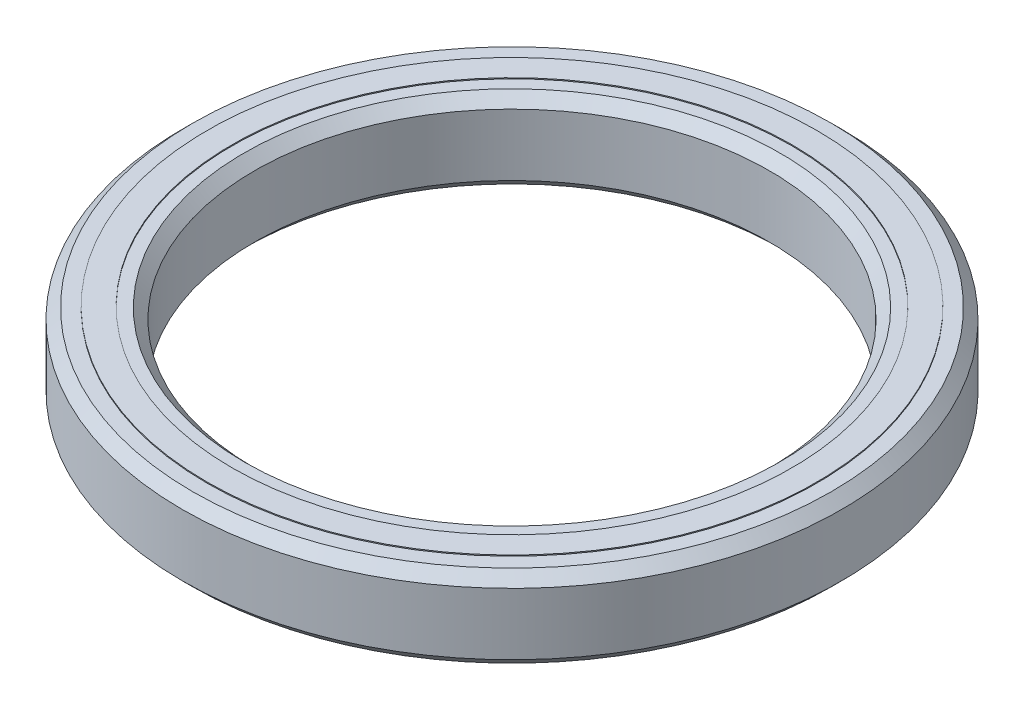
ISO-10303-21;
HEADER;
FILE_DESCRIPTION(('STEP AP214'),'2;1');
FILE_NAME('part.step','',(''),(''),'','','');
FILE_SCHEMA(('AUTOMOTIVE_DESIGN { 1 0 10303 214 1 1 1 1 }'));
ENDSEC;
DATA;
#1=APPLICATION_CONTEXT('core data for automotive mechanical design processes');
#2=APPLICATION_PROTOCOL_DEFINITION('international standard','automotive_design',2000,#1);
#3=PRODUCT_CONTEXT('',#1,'mechanical');
#4=PRODUCT('Part','Part','',(#3));
#5=PRODUCT_RELATED_PRODUCT_CATEGORY('part','',(#4));
#6=PRODUCT_DEFINITION_FORMATION('','',#4);
#7=PRODUCT_DEFINITION_CONTEXT('part definition',#1,'design');
#8=PRODUCT_DEFINITION('design','',#6,#7);
#9=PRODUCT_DEFINITION_SHAPE('','',#8);
#10=(LENGTH_UNIT() NAMED_UNIT(*) SI_UNIT(.MILLI.,.METRE.));
#11=(NAMED_UNIT(*) PLANE_ANGLE_UNIT() SI_UNIT($,.RADIAN.));
#12=(NAMED_UNIT(*) SI_UNIT($,.STERADIAN.) SOLID_ANGLE_UNIT());
#13=UNCERTAINTY_MEASURE_WITH_UNIT(LENGTH_MEASURE(1.E-05),#10,'distance_accuracy_value','');
#14=(GEOMETRIC_REPRESENTATION_CONTEXT(3) GLOBAL_UNCERTAINTY_ASSIGNED_CONTEXT((#13)) GLOBAL_UNIT_ASSIGNED_CONTEXT((#10,
#11,#12)) REPRESENTATION_CONTEXT('',''));
#15=CARTESIAN_POINT('',(0.,0.,0.));
#16=DIRECTION('',(0.,0.,1.));
#17=DIRECTION('',(1.,0.,0.));
#18=AXIS2_PLACEMENT_3D('',#15,#16,#17);
#19=CARTESIAN_POINT('',(0.,2.,0.));
#20=DIRECTION('',(0.,1.,0.));
#21=DIRECTION('',(0.,0.,1.));
#22=AXIS2_PLACEMENT_3D('',#19,#20,#21);
#23=PLANE('',#22);
#24=CARTESIAN_POINT('',(0.,2.,0.));
#25=DIRECTION('',(0.,1.,0.));
#26=DIRECTION('',(0.,0.,1.));
#27=AXIS2_PLACEMENT_3D('',#24,#25,#26);
#28=CIRCLE('',#27,14.7934604030925);
#29=CARTESIAN_POINT('',(0.,2.,14.7934604030925));
#30=VERTEX_POINT('',#29);
#31=EDGE_CURVE('E54',#30,#30,#28,.F.);
#32=ORIENTED_EDGE('',*,*,#31,.T.);
#33=EDGE_LOOP('',(#32));
#34=FACE_BOUND('',#33,.T.);
#35=CARTESIAN_POINT('',(0.,2.,0.));
#36=DIRECTION('',(0.,1.,0.));
#37=DIRECTION('',(0.,0.,1.));
#38=AXIS2_PLACEMENT_3D('',#35,#36,#37);
#39=CIRCLE('',#38,15.5);
#40=CARTESIAN_POINT('',(0.,2.,15.5));
#41=VERTEX_POINT('',#40);
#42=EDGE_CURVE('E70',#41,#41,#39,.T.);
#43=ORIENTED_EDGE('',*,*,#42,.T.);
#44=EDGE_LOOP('',(#43));
#45=FACE_BOUND('',#44,.T.);
#46=ADVANCED_FACE('F36',(#34,#45),#23,.T.);
#47=CARTESIAN_POINT('',(0.,-2.,0.));
#48=DIRECTION('',(0.,1.,0.));
#49=DIRECTION('',(0.,0.,1.));
#50=AXIS2_PLACEMENT_3D('',#47,#48,#49);
#51=PLANE('',#50);
#52=CARTESIAN_POINT('',(0.,-2.,0.));
#53=DIRECTION('',(0.,1.,0.));
#54=DIRECTION('',(0.,0.,1.));
#55=AXIS2_PLACEMENT_3D('',#52,#53,#54);
#56=CIRCLE('',#55,14.7934604030925);
#57=CARTESIAN_POINT('',(0.,-2.,14.7934604030925));
#58=VERTEX_POINT('',#57);
#59=EDGE_CURVE('E41',#58,#58,#56,.F.);
#60=ORIENTED_EDGE('',*,*,#59,.F.);
#61=EDGE_LOOP('',(#60));
#62=FACE_BOUND('',#61,.T.);
#63=CARTESIAN_POINT('',(0.,-2.,0.));
#64=DIRECTION('',(0.,1.,0.));
#65=DIRECTION('',(0.,0.,1.));
#66=AXIS2_PLACEMENT_3D('',#63,#64,#65);
#67=CIRCLE('',#66,15.5);
#68=CARTESIAN_POINT('',(0.,-2.,15.5));
#69=VERTEX_POINT('',#68);
#70=EDGE_CURVE('E57',#69,#69,#67,.F.);
#71=ORIENTED_EDGE('',*,*,#70,.T.);
#72=EDGE_LOOP('',(#71));
#73=FACE_BOUND('',#72,.T.);
#74=ADVANCED_FACE('F115',(#62,#73),#51,.F.);
#75=CARTESIAN_POINT('',(0.,2.,0.));
#76=DIRECTION('',(0.,-1.,0.));
#77=DIRECTION('',(0.,0.,-1.));
#78=AXIS2_PLACEMENT_3D('',#75,#76,#77);
#79=CYLINDRICAL_SURFACE('',#78,16.);
#80=CARTESIAN_POINT('',(0.,-1.49999999999999,0.));
#81=DIRECTION('',(0.,1.,0.));
#82=DIRECTION('',(0.,0.,1.));
#83=AXIS2_PLACEMENT_3D('',#80,#81,#82);
#84=CIRCLE('',#83,16.);
#85=CARTESIAN_POINT('',(0.,-1.49999999999999,16.));
#86=VERTEX_POINT('',#85);
#87=EDGE_CURVE('E49',#86,#86,#84,.T.);
#88=ORIENTED_EDGE('',*,*,#87,.T.);
#89=EDGE_LOOP('',(#88));
#90=FACE_BOUND('',#89,.T.);
#91=CARTESIAN_POINT('',(0.,1.49999999999999,0.));
#92=DIRECTION('',(0.,1.,0.));
#93=DIRECTION('',(0.,0.,1.));
#94=AXIS2_PLACEMENT_3D('',#91,#92,#93);
#95=CIRCLE('',#94,16.);
#96=CARTESIAN_POINT('',(0.,1.49999999999999,16.));
#97=VERTEX_POINT('',#96);
#98=EDGE_CURVE('E76',#97,#97,#95,.F.);
#99=ORIENTED_EDGE('',*,*,#98,.T.);
#100=EDGE_LOOP('',(#99));
#101=FACE_BOUND('',#100,.T.);
#102=ADVANCED_FACE('F122',(#90,#101),#79,.T.);
#103=CARTESIAN_POINT('',(0.,-1.49999999999999,0.));
#104=DIRECTION('',(0.,1.,0.));
#105=DIRECTION('',(0.,0.,1.));
#106=AXIS2_PLACEMENT_3D('',#103,#104,#105);
#107=CONICAL_SURFACE('',#106,16.,0.785398163397452);
#108=ORIENTED_EDGE('',*,*,#70,.F.);
#109=EDGE_LOOP('',(#108));
#110=FACE_BOUND('',#109,.T.);
#111=ORIENTED_EDGE('',*,*,#87,.F.);
#112=EDGE_LOOP('',(#111));
#113=FACE_BOUND('',#112,.T.);
#114=ADVANCED_FACE('F155',(#110,#113),#107,.T.);
#115=CARTESIAN_POINT('',(0.,2.,0.));
#116=DIRECTION('',(0.,-1.,0.));
#117=DIRECTION('',(0.,0.,-1.));
#118=AXIS2_PLACEMENT_3D('',#115,#116,#117);
#119=CONICAL_SURFACE('',#118,15.5,0.785398163397441);
#120=ORIENTED_EDGE('',*,*,#98,.F.);
#121=EDGE_LOOP('',(#120));
#122=FACE_BOUND('',#121,.T.);
#123=ORIENTED_EDGE('',*,*,#42,.F.);
#124=EDGE_LOOP('',(#123));
#125=FACE_BOUND('',#124,.T.);
#126=ADVANCED_FACE('F39',(#122,#125),#119,.T.);
#127=CARTESIAN_POINT('',(0.,2.05,0.));
#128=DIRECTION('',(0.,-1.,0.));
#129=DIRECTION('',(0.,0.,-1.));
#130=AXIS2_PLACEMENT_3D('',#127,#128,#129);
#131=CYLINDRICAL_SURFACE('',#130,14.7934604030925);
#132=CARTESIAN_POINT('',(0.,-2.05,0.));
#133=DIRECTION('',(0.,1.,0.));
#134=DIRECTION('',(0.,0.,1.));
#135=AXIS2_PLACEMENT_3D('',#132,#133,#134);
#136=CIRCLE('',#135,14.7934604030925);
#137=CARTESIAN_POINT('',(0.,-2.05,14.7934604030925));
#138=VERTEX_POINT('',#137);
#139=EDGE_CURVE('E52',#138,#138,#136,.T.);
#140=ORIENTED_EDGE('',*,*,#139,.T.);
#141=EDGE_LOOP('',(#140));
#142=FACE_BOUND('',#141,.T.);
#143=ORIENTED_EDGE('',*,*,#59,.T.);
#144=EDGE_LOOP('',(#143));
#145=FACE_BOUND('',#144,.T.);
#146=ADVANCED_FACE('F109',(#142,#145),#131,.T.);
#147=CARTESIAN_POINT('',(0.,-2.05,0.));
#148=DIRECTION('',(0.,1.,0.));
#149=DIRECTION('',(0.,0.,1.));
#150=AXIS2_PLACEMENT_3D('',#147,#148,#149);
#151=PLANE('',#150);
#152=ORIENTED_EDGE('',*,*,#139,.F.);
#153=EDGE_LOOP('',(#152));
#154=FACE_BOUND('',#153,.T.);
#155=CARTESIAN_POINT('',(0.,-2.05,0.));
#156=DIRECTION('',(0.,1.,0.));
#157=DIRECTION('',(0.,0.,1.));
#158=AXIS2_PLACEMENT_3D('',#155,#156,#157);
#159=CIRCLE('',#158,13.5904737587394);
#160=CARTESIAN_POINT('',(0.,-2.05,13.5904737587394));
#161=VERTEX_POINT('',#160);
#162=EDGE_CURVE('E90',#161,#161,#159,.T.);
#163=ORIENTED_EDGE('',*,*,#162,.T.);
#164=EDGE_LOOP('',(#163));
#165=FACE_BOUND('',#164,.T.);
#166=ADVANCED_FACE('F110',(#154,#165),#151,.F.);
#167=CARTESIAN_POINT('',(0.,2.05,0.));
#168=DIRECTION('',(0.,-1.,0.));
#169=DIRECTION('',(0.,0.,-1.));
#170=AXIS2_PLACEMENT_3D('',#167,#168,#169);
#171=CYLINDRICAL_SURFACE('',#170,13.5904737587394);
#172=ORIENTED_EDGE('',*,*,#162,.F.);
#173=EDGE_LOOP('',(#172));
#174=FACE_BOUND('',#173,.T.);
#175=CARTESIAN_POINT('',(0.,-2.,0.));
#176=DIRECTION('',(0.,1.,0.));
#177=DIRECTION('',(0.,0.,1.));
#178=AXIS2_PLACEMENT_3D('',#175,#176,#177);
#179=CIRCLE('',#178,13.5904737587394);
#180=CARTESIAN_POINT('',(0.,-2.,13.5904737587394));
#181=VERTEX_POINT('',#180);
#182=EDGE_CURVE('E58',#181,#181,#179,.F.);
#183=ORIENTED_EDGE('',*,*,#182,.F.);
#184=EDGE_LOOP('',(#183));
#185=FACE_BOUND('',#184,.T.);
#186=ADVANCED_FACE('F101',(#174,#185),#171,.F.);
#187=CARTESIAN_POINT('',(0.,2.05,0.));
#188=DIRECTION('',(0.,1.,0.));
#189=DIRECTION('',(0.,0.,1.));
#190=AXIS2_PLACEMENT_3D('',#187,#188,#189);
#191=PLANE('',#190);
#192=CARTESIAN_POINT('',(0.,2.05,0.));
#193=DIRECTION('',(0.,1.,0.));
#194=DIRECTION('',(0.,0.,1.));
#195=AXIS2_PLACEMENT_3D('',#192,#193,#194);
#196=CIRCLE('',#195,14.7934604030925);
#197=CARTESIAN_POINT('',(0.,2.05,14.7934604030925));
#198=VERTEX_POINT('',#197);
#199=EDGE_CURVE('E81',#198,#198,#196,.T.);
#200=ORIENTED_EDGE('',*,*,#199,.T.);
#201=EDGE_LOOP('',(#200));
#202=FACE_BOUND('',#201,.T.);
#203=CARTESIAN_POINT('',(0.,2.05,0.));
#204=DIRECTION('',(0.,1.,0.));
#205=DIRECTION('',(0.,0.,1.));
#206=AXIS2_PLACEMENT_3D('',#203,#204,#205);
#207=CIRCLE('',#206,13.5904737587394);
#208=CARTESIAN_POINT('',(0.,2.05,13.5904737587394));
#209=VERTEX_POINT('',#208);
#210=EDGE_CURVE('E88',#209,#209,#207,.T.);
#211=ORIENTED_EDGE('',*,*,#210,.F.);
#212=EDGE_LOOP('',(#211));
#213=FACE_BOUND('',#212,.T.);
#214=ADVANCED_FACE('F98',(#202,#213),#191,.T.);
#215=ORIENTED_EDGE('',*,*,#31,.F.);
#216=EDGE_LOOP('',(#215));
#217=FACE_BOUND('',#216,.T.);
#218=ORIENTED_EDGE('',*,*,#199,.F.);
#219=EDGE_LOOP('',(#218));
#220=FACE_BOUND('',#219,.T.);
#221=ADVANCED_FACE('F100',(#217,#220),#131,.T.);
#222=CARTESIAN_POINT('',(0.,2.,0.));
#223=DIRECTION('',(0.,1.,0.));
#224=DIRECTION('',(0.,0.,1.));
#225=AXIS2_PLACEMENT_3D('',#222,#223,#224);
#226=CIRCLE('',#225,13.5904737587394);
#227=CARTESIAN_POINT('',(0.,2.,13.5904737587394));
#228=VERTEX_POINT('',#227);
#229=EDGE_CURVE('E10',#228,#228,#226,.F.);
#230=ORIENTED_EDGE('',*,*,#229,.T.);
#231=EDGE_LOOP('',(#230));
#232=FACE_BOUND('',#231,.T.);
#233=ORIENTED_EDGE('',*,*,#210,.T.);
#234=EDGE_LOOP('',(#233));
#235=FACE_BOUND('',#234,.T.);
#236=ADVANCED_FACE('F96',(#232,#235),#171,.F.);
#237=CARTESIAN_POINT('',(0.,1.49999999999998,0.));
#238=DIRECTION('',(0.,1.,0.));
#239=DIRECTION('',(0.,0.,1.));
#240=AXIS2_PLACEMENT_3D('',#237,#238,#239);
#241=CONICAL_SURFACE('',#240,12.5,0.785398163397453);
#242=CARTESIAN_POINT('',(0.,2.,0.));
#243=DIRECTION('',(0.,1.,0.));
#244=DIRECTION('',(0.,0.,1.));
#245=AXIS2_PLACEMENT_3D('',#242,#243,#244);
#246=CIRCLE('',#245,13.);
#247=CARTESIAN_POINT('',(0.,2.,13.));
#248=VERTEX_POINT('',#247);
#249=EDGE_CURVE('E73',#248,#248,#246,.F.);
#250=ORIENTED_EDGE('',*,*,#249,.F.);
#251=EDGE_LOOP('',(#250));
#252=FACE_BOUND('',#251,.T.);
#253=CARTESIAN_POINT('',(0.,1.49999999999998,0.));
#254=DIRECTION('',(0.,1.,0.));
#255=DIRECTION('',(0.,0.,1.));
#256=AXIS2_PLACEMENT_3D('',#253,#254,#255);
#257=CIRCLE('',#256,12.5);
#258=CARTESIAN_POINT('',(0.,1.49999999999998,12.5));
#259=VERTEX_POINT('',#258);
#260=EDGE_CURVE('E64',#259,#259,#257,.T.);
#261=ORIENTED_EDGE('',*,*,#260,.F.);
#262=EDGE_LOOP('',(#261));
#263=FACE_BOUND('',#262,.T.);
#264=ADVANCED_FACE('F130',(#252,#263),#241,.F.);
#265=ORIENTED_EDGE('',*,*,#249,.T.);
#266=EDGE_LOOP('',(#265));
#267=FACE_BOUND('',#266,.T.);
#268=ORIENTED_EDGE('',*,*,#229,.F.);
#269=EDGE_LOOP('',(#268));
#270=FACE_BOUND('',#269,.T.);
#271=ADVANCED_FACE('F118',(#267,#270),#23,.T.);
#272=CARTESIAN_POINT('',(0.,2.,0.));
#273=DIRECTION('',(0.,-1.,0.));
#274=DIRECTION('',(0.,0.,-1.));
#275=AXIS2_PLACEMENT_3D('',#272,#273,#274);
#276=CYLINDRICAL_SURFACE('',#275,12.5);
#277=CARTESIAN_POINT('',(0.,-1.5,0.));
#278=DIRECTION('',(0.,1.,0.));
#279=DIRECTION('',(0.,0.,1.));
#280=AXIS2_PLACEMENT_3D('',#277,#278,#279);
#281=CIRCLE('',#280,12.5);
#282=CARTESIAN_POINT('',(0.,-1.5,12.5));
#283=VERTEX_POINT('',#282);
#284=EDGE_CURVE('E67',#283,#283,#281,.F.);
#285=ORIENTED_EDGE('',*,*,#284,.T.);
#286=EDGE_LOOP('',(#285));
#287=FACE_BOUND('',#286,.T.);
#288=ORIENTED_EDGE('',*,*,#260,.T.);
#289=EDGE_LOOP('',(#288));
#290=FACE_BOUND('',#289,.T.);
#291=ADVANCED_FACE('F129',(#287,#290),#276,.F.);
#292=CARTESIAN_POINT('',(0.,-2.,0.));
#293=DIRECTION('',(0.,-1.,0.));
#294=DIRECTION('',(0.,0.,-1.));
#295=AXIS2_PLACEMENT_3D('',#292,#293,#294);
#296=CONICAL_SURFACE('',#295,13.,0.78539816339744);
#297=ORIENTED_EDGE('',*,*,#284,.F.);
#298=EDGE_LOOP('',(#297));
#299=FACE_BOUND('',#298,.T.);
#300=CARTESIAN_POINT('',(0.,-2.,0.));
#301=DIRECTION('',(0.,1.,0.));
#302=DIRECTION('',(0.,0.,1.));
#303=AXIS2_PLACEMENT_3D('',#300,#301,#302);
#304=CIRCLE('',#303,13.);
#305=CARTESIAN_POINT('',(0.,-2.,13.));
#306=VERTEX_POINT('',#305);
#307=EDGE_CURVE('E61',#306,#306,#304,.T.);
#308=ORIENTED_EDGE('',*,*,#307,.F.);
#309=EDGE_LOOP('',(#308));
#310=FACE_BOUND('',#309,.T.);
#311=ADVANCED_FACE('F136',(#299,#310),#296,.F.);
#312=ORIENTED_EDGE('',*,*,#307,.T.);
#313=EDGE_LOOP('',(#312));
#314=FACE_BOUND('',#313,.T.);
#315=ORIENTED_EDGE('',*,*,#182,.T.);
#316=EDGE_LOOP('',(#315));
#317=FACE_BOUND('',#316,.T.);
#318=ADVANCED_FACE('F125',(#314,#317),#51,.F.);
#319=CLOSED_SHELL('',(#46,#74,#102,#114,#126,#146,#166,#186,#214,#221,#236,#264,#271,#291,#311,#318));
#320=MANIFOLD_SOLID_BREP('B2',#319);
#321=ADVANCED_BREP_SHAPE_REPRESENTATION('',(#18,#320),#14);
#322=SHAPE_DEFINITION_REPRESENTATION(#9,#321);
ENDSEC;
END-ISO-10303-21;
